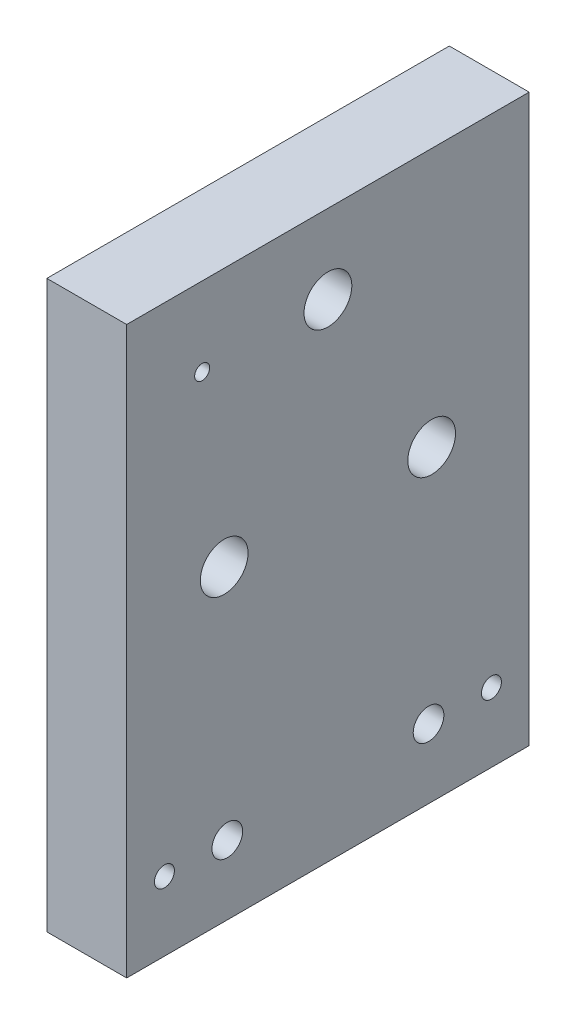
ISO-10303-21;
HEADER;
FILE_DESCRIPTION(('STEP AP214'),'2;1');
FILE_NAME('part.step','',(''),(''),'','','');
FILE_SCHEMA(('AUTOMOTIVE_DESIGN { 1 0 10303 214 1 1 1 1 }'));
ENDSEC;
DATA;
#1=APPLICATION_CONTEXT('core data for automotive mechanical design processes');
#2=APPLICATION_PROTOCOL_DEFINITION('international standard','automotive_design',2000,#1);
#3=PRODUCT_CONTEXT('',#1,'mechanical');
#4=PRODUCT('Part','Part','',(#3));
#5=PRODUCT_RELATED_PRODUCT_CATEGORY('part','',(#4));
#6=PRODUCT_DEFINITION_FORMATION('','',#4);
#7=PRODUCT_DEFINITION_CONTEXT('part definition',#1,'design');
#8=PRODUCT_DEFINITION('design','',#6,#7);
#9=PRODUCT_DEFINITION_SHAPE('','',#8);
#10=(LENGTH_UNIT() NAMED_UNIT(*) SI_UNIT(.MILLI.,.METRE.));
#11=(NAMED_UNIT(*) PLANE_ANGLE_UNIT() SI_UNIT($,.RADIAN.));
#12=(NAMED_UNIT(*) SI_UNIT($,.STERADIAN.) SOLID_ANGLE_UNIT());
#13=UNCERTAINTY_MEASURE_WITH_UNIT(LENGTH_MEASURE(1.E-05),#10,'distance_accuracy_value','');
#14=(GEOMETRIC_REPRESENTATION_CONTEXT(3) GLOBAL_UNCERTAINTY_ASSIGNED_CONTEXT((#13)) GLOBAL_UNIT_ASSIGNED_CONTEXT((#10,
#11,#12)) REPRESENTATION_CONTEXT('',''));
#15=CARTESIAN_POINT('',(0.,0.,0.));
#16=DIRECTION('',(0.,0.,1.));
#17=DIRECTION('',(1.,0.,0.));
#18=AXIS2_PLACEMENT_3D('',#15,#16,#17);
#19=CARTESIAN_POINT('',(6.35,45.,0.));
#20=DIRECTION('',(-1.,0.,0.));
#21=DIRECTION('',(0.,0.,1.));
#22=AXIS2_PLACEMENT_3D('',#19,#20,#21);
#23=PLANE('',#22);
#24=CARTESIAN_POINT('',(6.35,5.50000000000001,29.));
#25=DIRECTION('',(1.,0.,0.));
#26=DIRECTION('',(0.,0.,-1.));
#27=AXIS2_PLACEMENT_3D('',#24,#25,#26);
#28=CIRCLE('',#27,0.793749999999989);
#29=CARTESIAN_POINT('',(6.35,5.50000000000001,28.20625));
#30=VERTEX_POINT('',#29);
#31=EDGE_CURVE('E103',#30,#30,#28,.T.);
#32=ORIENTED_EDGE('',*,*,#31,.F.);
#33=EDGE_LOOP('',(#32));
#34=FACE_BOUND('',#33,.T.);
#35=CARTESIAN_POINT('',(6.35,5.50000000000001,3.));
#36=DIRECTION('',(1.,0.,0.));
#37=DIRECTION('',(0.,0.,-1.));
#38=AXIS2_PLACEMENT_3D('',#35,#36,#37);
#39=CIRCLE('',#38,0.793749999999989);
#40=CARTESIAN_POINT('',(6.35,5.50000000000001,2.20625000000002));
#41=VERTEX_POINT('',#40);
#42=EDGE_CURVE('E102',#41,#41,#39,.T.);
#43=ORIENTED_EDGE('',*,*,#42,.F.);
#44=EDGE_LOOP('',(#43));
#45=FACE_BOUND('',#44,.T.);
#46=CARTESIAN_POINT('',(6.35,5.50000000000001,8.00000000000001));
#47=DIRECTION('',(-1.,0.,0.));
#48=DIRECTION('',(0.,0.,1.));
#49=AXIS2_PLACEMENT_3D('',#46,#47,#48);
#50=CIRCLE('',#49,1.2192);
#51=CARTESIAN_POINT('',(6.35,5.50000000000001,9.21920000000001));
#52=VERTEX_POINT('',#51);
#53=EDGE_CURVE('E116',#52,#52,#50,.T.);
#54=ORIENTED_EDGE('',*,*,#53,.T.);
#55=EDGE_LOOP('',(#54));
#56=FACE_BOUND('',#55,.T.);
#57=CARTESIAN_POINT('',(6.35,5.50000000000001,24.));
#58=DIRECTION('',(-1.,0.,0.));
#59=DIRECTION('',(0.,0.,1.));
#60=AXIS2_PLACEMENT_3D('',#57,#58,#59);
#61=CIRCLE('',#60,1.2192);
#62=CARTESIAN_POINT('',(6.35,5.50000000000001,25.2192));
#63=VERTEX_POINT('',#62);
#64=EDGE_CURVE('E122',#63,#63,#61,.T.);
#65=ORIENTED_EDGE('',*,*,#64,.T.);
#66=EDGE_LOOP('',(#65));
#67=FACE_BOUND('',#66,.T.);
#68=CARTESIAN_POINT('',(6.35,38.7250000001695,26.));
#69=DIRECTION('',(-1.,0.,0.));
#70=DIRECTION('',(0.,0.,1.));
#71=AXIS2_PLACEMENT_3D('',#68,#69,#70);
#72=CIRCLE('',#71,0.595629999999993);
#73=CARTESIAN_POINT('',(6.35,38.7250000001695,26.59563));
#74=VERTEX_POINT('',#73);
#75=EDGE_CURVE('E128',#74,#74,#72,.T.);
#76=ORIENTED_EDGE('',*,*,#75,.T.);
#77=EDGE_LOOP('',(#76));
#78=FACE_BOUND('',#77,.T.);
#79=CARTESIAN_POINT('',(6.35,38.7250000001695,16.));
#80=DIRECTION('',(-1.,0.,0.));
#81=DIRECTION('',(0.,0.,1.));
#82=AXIS2_PLACEMENT_3D('',#79,#80,#81);
#83=CIRCLE('',#82,1.89864999999999);
#84=CARTESIAN_POINT('',(6.35,38.7250000001695,17.89865));
#85=VERTEX_POINT('',#84);
#86=EDGE_CURVE('E39',#85,#85,#83,.T.);
#87=ORIENTED_EDGE('',*,*,#86,.T.);
#88=EDGE_LOOP('',(#87));
#89=FACE_BOUND('',#88,.T.);
#90=CARTESIAN_POINT('',(6.35,24.4375000000845,24.2488919710468));
#91=DIRECTION('',(-1.,0.,0.));
#92=DIRECTION('',(0.,0.,1.));
#93=AXIS2_PLACEMENT_3D('',#90,#91,#92);
#94=CIRCLE('',#93,1.89864999999999);
#95=CARTESIAN_POINT('',(6.35,24.4375000000845,26.1475419710468));
#96=VERTEX_POINT('',#95);
#97=EDGE_CURVE('E149',#96,#96,#94,.T.);
#98=ORIENTED_EDGE('',*,*,#97,.T.);
#99=EDGE_LOOP('',(#98));
#100=FACE_BOUND('',#99,.T.);
#101=CARTESIAN_POINT('',(6.35,24.4375000000845,7.75110802895321));
#102=DIRECTION('',(-1.,0.,0.));
#103=DIRECTION('',(0.,0.,1.));
#104=AXIS2_PLACEMENT_3D('',#101,#102,#103);
#105=CIRCLE('',#104,1.89864999999999);
#106=CARTESIAN_POINT('',(6.35,24.4375000000845,9.6497580289532));
#107=VERTEX_POINT('',#106);
#108=EDGE_CURVE('E159',#107,#107,#105,.T.);
#109=ORIENTED_EDGE('',*,*,#108,.T.);
#110=EDGE_LOOP('',(#109));
#111=FACE_BOUND('',#110,.T.);
#112=DIRECTION('',(0.,0.,-1.));
#113=VECTOR('',#112,1.);
#114=CARTESIAN_POINT('',(6.35,0.,0.));
#115=LINE('',#114,#113);
#116=CARTESIAN_POINT('',(6.35,0.,32.));
#117=VERTEX_POINT('',#116);
#118=CARTESIAN_POINT('',(6.35,0.,0.));
#119=VERTEX_POINT('',#118);
#120=EDGE_CURVE('E167',#117,#119,#115,.T.);
#121=ORIENTED_EDGE('',*,*,#120,.T.);
#122=DIRECTION('',(0.,-1.,0.));
#123=VECTOR('',#122,1.);
#124=CARTESIAN_POINT('',(6.35,45.,0.));
#125=LINE('',#124,#123);
#126=CARTESIAN_POINT('',(6.35,45.,0.));
#127=VERTEX_POINT('',#126);
#128=EDGE_CURVE('E11',#127,#119,#125,.T.);
#129=ORIENTED_EDGE('',*,*,#128,.F.);
#130=DIRECTION('',(0.,0.,-1.));
#131=VECTOR('',#130,1.);
#132=CARTESIAN_POINT('',(6.35,45.,0.));
#133=LINE('',#132,#131);
#134=CARTESIAN_POINT('',(6.35,45.,32.));
#135=VERTEX_POINT('',#134);
#136=EDGE_CURVE('E160',#135,#127,#133,.T.);
#137=ORIENTED_EDGE('',*,*,#136,.F.);
#138=DIRECTION('',(0.,-1.,0.));
#139=VECTOR('',#138,1.);
#140=CARTESIAN_POINT('',(6.35,45.,32.));
#141=LINE('',#140,#139);
#142=EDGE_CURVE('E166',#135,#117,#141,.T.);
#143=ORIENTED_EDGE('',*,*,#142,.T.);
#144=EDGE_LOOP('',(#121,#129,#137,#143));
#145=FACE_BOUND('',#144,.T.);
#146=ADVANCED_FACE('F36',(#34,#45,#56,#67,#78,#89,#100,#111,#145),#23,.F.);
#147=CARTESIAN_POINT('',(6.35,45.,0.));
#148=DIRECTION('',(0.,0.,1.));
#149=DIRECTION('',(1.,0.,0.));
#150=AXIS2_PLACEMENT_3D('',#147,#148,#149);
#151=PLANE('',#150);
#152=DIRECTION('',(-1.,0.,0.));
#153=VECTOR('',#152,1.);
#154=CARTESIAN_POINT('',(6.35,0.,0.));
#155=LINE('',#154,#153);
#156=CARTESIAN_POINT('',(0.,0.,0.));
#157=VERTEX_POINT('',#156);
#158=EDGE_CURVE('E170',#119,#157,#155,.T.);
#159=ORIENTED_EDGE('',*,*,#158,.T.);
#160=DIRECTION('',(0.,-1.,0.));
#161=VECTOR('',#160,1.);
#162=CARTESIAN_POINT('',(0.,45.,0.));
#163=LINE('',#162,#161);
#164=CARTESIAN_POINT('',(0.,45.,0.));
#165=VERTEX_POINT('',#164);
#166=EDGE_CURVE('E45',#165,#157,#163,.T.);
#167=ORIENTED_EDGE('',*,*,#166,.F.);
#168=DIRECTION('',(-1.,0.,0.));
#169=VECTOR('',#168,1.);
#170=CARTESIAN_POINT('',(6.35,45.,0.));
#171=LINE('',#170,#169);
#172=EDGE_CURVE('E85',#127,#165,#171,.T.);
#173=ORIENTED_EDGE('',*,*,#172,.F.);
#174=ORIENTED_EDGE('',*,*,#128,.T.);
#175=EDGE_LOOP('',(#159,#167,#173,#174));
#176=FACE_BOUND('',#175,.T.);
#177=ADVANCED_FACE('F201',(#176),#151,.F.);
#178=CARTESIAN_POINT('',(0.,45.,0.));
#179=DIRECTION('',(1.,0.,0.));
#180=DIRECTION('',(0.,0.,-1.));
#181=AXIS2_PLACEMENT_3D('',#178,#179,#180);
#182=PLANE('',#181);
#183=CARTESIAN_POINT('',(0.,5.50000000000001,8.00000000000001));
#184=DIRECTION('',(-1.,0.,0.));
#185=DIRECTION('',(0.,0.,1.));
#186=AXIS2_PLACEMENT_3D('',#183,#184,#185);
#187=CIRCLE('',#186,1.2192);
#188=CARTESIAN_POINT('',(0.,5.50000000000001,9.21920000000001));
#189=VERTEX_POINT('',#188);
#190=EDGE_CURVE('E113',#189,#189,#187,.T.);
#191=ORIENTED_EDGE('',*,*,#190,.F.);
#192=EDGE_LOOP('',(#191));
#193=FACE_BOUND('',#192,.T.);
#194=CARTESIAN_POINT('',(0.,5.50000000000001,24.));
#195=DIRECTION('',(-1.,0.,0.));
#196=DIRECTION('',(0.,0.,1.));
#197=AXIS2_PLACEMENT_3D('',#194,#195,#196);
#198=CIRCLE('',#197,1.2192);
#199=CARTESIAN_POINT('',(0.,5.50000000000001,25.2192));
#200=VERTEX_POINT('',#199);
#201=EDGE_CURVE('E119',#200,#200,#198,.T.);
#202=ORIENTED_EDGE('',*,*,#201,.F.);
#203=EDGE_LOOP('',(#202));
#204=FACE_BOUND('',#203,.T.);
#205=CARTESIAN_POINT('',(0.,38.7250000001695,26.));
#206=DIRECTION('',(-1.,0.,0.));
#207=DIRECTION('',(0.,0.,1.));
#208=AXIS2_PLACEMENT_3D('',#205,#206,#207);
#209=CIRCLE('',#208,0.595629999999986);
#210=CARTESIAN_POINT('',(0.,38.7250000001695,26.59563));
#211=VERTEX_POINT('',#210);
#212=EDGE_CURVE('E125',#211,#211,#209,.T.);
#213=ORIENTED_EDGE('',*,*,#212,.F.);
#214=EDGE_LOOP('',(#213));
#215=FACE_BOUND('',#214,.T.);
#216=CARTESIAN_POINT('',(0.,38.7250000001695,16.));
#217=DIRECTION('',(-1.,0.,0.));
#218=DIRECTION('',(0.,0.,1.));
#219=AXIS2_PLACEMENT_3D('',#216,#217,#218);
#220=CIRCLE('',#219,4.7625);
#221=CARTESIAN_POINT('',(0.,38.7250000001695,20.7625));
#222=VERTEX_POINT('',#221);
#223=EDGE_CURVE('E131',#222,#222,#220,.T.);
#224=ORIENTED_EDGE('',*,*,#223,.F.);
#225=EDGE_LOOP('',(#224));
#226=FACE_BOUND('',#225,.T.);
#227=CARTESIAN_POINT('',(0.,24.4375000000845,24.2488919710468));
#228=DIRECTION('',(-1.,0.,0.));
#229=DIRECTION('',(0.,0.,1.));
#230=AXIS2_PLACEMENT_3D('',#227,#228,#229);
#231=CIRCLE('',#230,4.7625);
#232=CARTESIAN_POINT('',(0.,24.4375000000845,29.0113919710468));
#233=VERTEX_POINT('',#232);
#234=EDGE_CURVE('E140',#233,#233,#231,.T.);
#235=ORIENTED_EDGE('',*,*,#234,.F.);
#236=EDGE_LOOP('',(#235));
#237=FACE_BOUND('',#236,.T.);
#238=CARTESIAN_POINT('',(0.,24.4375000000845,7.75110802895321));
#239=DIRECTION('',(-1.,0.,0.));
#240=DIRECTION('',(0.,0.,1.));
#241=AXIS2_PLACEMENT_3D('',#238,#239,#240);
#242=CIRCLE('',#241,4.7625);
#243=CARTESIAN_POINT('',(0.,24.4375000000845,12.5136080289532));
#244=VERTEX_POINT('',#243);
#245=EDGE_CURVE('E150',#244,#244,#242,.T.);
#246=ORIENTED_EDGE('',*,*,#245,.F.);
#247=EDGE_LOOP('',(#246));
#248=FACE_BOUND('',#247,.T.);
#249=DIRECTION('',(0.,0.,1.));
#250=VECTOR('',#249,1.);
#251=CARTESIAN_POINT('',(0.,0.,0.));
#252=LINE('',#251,#250);
#253=CARTESIAN_POINT('',(0.,0.,32.));
#254=VERTEX_POINT('',#253);
#255=EDGE_CURVE('E72',#157,#254,#252,.T.);
#256=ORIENTED_EDGE('',*,*,#255,.T.);
#257=DIRECTION('',(0.,-1.,0.));
#258=VECTOR('',#257,1.);
#259=CARTESIAN_POINT('',(0.,45.,32.));
#260=LINE('',#259,#258);
#261=CARTESIAN_POINT('',(0.,45.,32.));
#262=VERTEX_POINT('',#261);
#263=EDGE_CURVE('E175',#262,#254,#260,.T.);
#264=ORIENTED_EDGE('',*,*,#263,.F.);
#265=DIRECTION('',(0.,0.,1.));
#266=VECTOR('',#265,1.);
#267=CARTESIAN_POINT('',(0.,45.,0.));
#268=LINE('',#267,#266);
#269=EDGE_CURVE('E163',#165,#262,#268,.T.);
#270=ORIENTED_EDGE('',*,*,#269,.F.);
#271=ORIENTED_EDGE('',*,*,#166,.T.);
#272=EDGE_LOOP('',(#256,#264,#270,#271));
#273=FACE_BOUND('',#272,.T.);
#274=ADVANCED_FACE('F206',(#193,#204,#215,#226,#237,#248,#273),#182,.F.);
#275=CARTESIAN_POINT('',(6.35,45.,32.));
#276=DIRECTION('',(0.,0.,-1.));
#277=DIRECTION('',(-1.,0.,0.));
#278=AXIS2_PLACEMENT_3D('',#275,#276,#277);
#279=PLANE('',#278);
#280=DIRECTION('',(1.,0.,0.));
#281=VECTOR('',#280,1.);
#282=CARTESIAN_POINT('',(6.35,0.,32.));
#283=LINE('',#282,#281);
#284=EDGE_CURVE('E78',#254,#117,#283,.T.);
#285=ORIENTED_EDGE('',*,*,#284,.T.);
#286=ORIENTED_EDGE('',*,*,#142,.F.);
#287=DIRECTION('',(1.,0.,0.));
#288=VECTOR('',#287,1.);
#289=CARTESIAN_POINT('',(6.35,45.,32.));
#290=LINE('',#289,#288);
#291=EDGE_CURVE('E54',#262,#135,#290,.T.);
#292=ORIENTED_EDGE('',*,*,#291,.F.);
#293=ORIENTED_EDGE('',*,*,#263,.T.);
#294=EDGE_LOOP('',(#285,#286,#292,#293));
#295=FACE_BOUND('',#294,.T.);
#296=ADVANCED_FACE('F360',(#295),#279,.F.);
#297=CARTESIAN_POINT('',(0.,45.,0.));
#298=DIRECTION('',(0.,-1.,0.));
#299=DIRECTION('',(0.,0.,-1.));
#300=AXIS2_PLACEMENT_3D('',#297,#298,#299);
#301=PLANE('',#300);
#302=ORIENTED_EDGE('',*,*,#136,.T.);
#303=ORIENTED_EDGE('',*,*,#172,.T.);
#304=ORIENTED_EDGE('',*,*,#269,.T.);
#305=ORIENTED_EDGE('',*,*,#291,.T.);
#306=EDGE_LOOP('',(#302,#303,#304,#305));
#307=FACE_BOUND('',#306,.T.);
#308=ADVANCED_FACE('F350',(#307),#301,.F.);
#309=CARTESIAN_POINT('',(0.,0.,0.));
#310=DIRECTION('',(0.,-1.,0.));
#311=DIRECTION('',(0.,0.,-1.));
#312=AXIS2_PLACEMENT_3D('',#309,#310,#311);
#313=PLANE('',#312);
#314=ORIENTED_EDGE('',*,*,#120,.F.);
#315=ORIENTED_EDGE('',*,*,#284,.F.);
#316=ORIENTED_EDGE('',*,*,#255,.F.);
#317=ORIENTED_EDGE('',*,*,#158,.F.);
#318=EDGE_LOOP('',(#314,#315,#316,#317));
#319=FACE_BOUND('',#318,.T.);
#320=ADVANCED_FACE('F340',(#319),#313,.T.);
#321=CARTESIAN_POINT('',(0.,24.4375000000845,7.75110802895321));
#322=DIRECTION('',(-1.,0.,0.));
#323=DIRECTION('',(0.,0.,1.));
#324=AXIS2_PLACEMENT_3D('',#321,#322,#323);
#325=CYLINDRICAL_SURFACE('',#324,1.89864999999999);
#326=CARTESIAN_POINT('',(1.016,24.4375000000845,7.75110802895321));
#327=DIRECTION('',(-1.,0.,0.));
#328=DIRECTION('',(0.,0.,1.));
#329=AXIS2_PLACEMENT_3D('',#326,#327,#328);
#330=CIRCLE('',#329,1.89864999999999);
#331=CARTESIAN_POINT('',(1.016,24.4375000000845,9.64975802895321));
#332=VERTEX_POINT('',#331);
#333=EDGE_CURVE('E156',#332,#332,#330,.T.);
#334=ORIENTED_EDGE('',*,*,#333,.T.);
#335=EDGE_LOOP('',(#334));
#336=FACE_BOUND('',#335,.T.);
#337=ORIENTED_EDGE('',*,*,#108,.F.);
#338=EDGE_LOOP('',(#337));
#339=FACE_BOUND('',#338,.T.);
#340=ADVANCED_FACE('F330',(#336,#339),#325,.F.);
#341=CARTESIAN_POINT('',(1.016,26.3361500000845,7.75110802895321));
#342=DIRECTION('',(1.,0.,0.));
#343=DIRECTION('',(0.,0.,-1.));
#344=AXIS2_PLACEMENT_3D('',#341,#342,#343);
#345=PLANE('',#344);
#346=ORIENTED_EDGE('',*,*,#333,.F.);
#347=EDGE_LOOP('',(#346));
#348=FACE_BOUND('',#347,.T.);
#349=CARTESIAN_POINT('',(1.016,24.4375000000845,7.75110802895321));
#350=DIRECTION('',(-1.,0.,0.));
#351=DIRECTION('',(0.,0.,1.));
#352=AXIS2_PLACEMENT_3D('',#349,#350,#351);
#353=CIRCLE('',#352,4.7625);
#354=CARTESIAN_POINT('',(1.016,24.4375000000845,12.5136080289532));
#355=VERTEX_POINT('',#354);
#356=EDGE_CURVE('E153',#355,#355,#353,.T.);
#357=ORIENTED_EDGE('',*,*,#356,.T.);
#358=EDGE_LOOP('',(#357));
#359=FACE_BOUND('',#358,.T.);
#360=ADVANCED_FACE('F197',(#348,#359),#345,.F.);
#361=CARTESIAN_POINT('',(0.,24.4375000000845,7.75110802895321));
#362=DIRECTION('',(-1.,0.,0.));
#363=DIRECTION('',(0.,0.,1.));
#364=AXIS2_PLACEMENT_3D('',#361,#362,#363);
#365=CYLINDRICAL_SURFACE('',#364,4.7625);
#366=ORIENTED_EDGE('',*,*,#356,.F.);
#367=EDGE_LOOP('',(#366));
#368=FACE_BOUND('',#367,.T.);
#369=ORIENTED_EDGE('',*,*,#245,.T.);
#370=EDGE_LOOP('',(#369));
#371=FACE_BOUND('',#370,.T.);
#372=ADVANCED_FACE('F187',(#368,#371),#365,.F.);
#373=CARTESIAN_POINT('',(0.,24.4375000000845,24.2488919710468));
#374=DIRECTION('',(-1.,0.,0.));
#375=DIRECTION('',(0.,0.,1.));
#376=AXIS2_PLACEMENT_3D('',#373,#374,#375);
#377=CYLINDRICAL_SURFACE('',#376,1.89864999999999);
#378=CARTESIAN_POINT('',(1.016,24.4375000000845,24.2488919710468));
#379=DIRECTION('',(-1.,0.,0.));
#380=DIRECTION('',(0.,0.,1.));
#381=AXIS2_PLACEMENT_3D('',#378,#379,#380);
#382=CIRCLE('',#381,1.89864999999999);
#383=CARTESIAN_POINT('',(1.016,24.4375000000845,26.1475419710468));
#384=VERTEX_POINT('',#383);
#385=EDGE_CURVE('E146',#384,#384,#382,.T.);
#386=ORIENTED_EDGE('',*,*,#385,.T.);
#387=EDGE_LOOP('',(#386));
#388=FACE_BOUND('',#387,.T.);
#389=ORIENTED_EDGE('',*,*,#97,.F.);
#390=EDGE_LOOP('',(#389));
#391=FACE_BOUND('',#390,.T.);
#392=ADVANCED_FACE('F184',(#388,#391),#377,.F.);
#393=CARTESIAN_POINT('',(1.016,26.3361500000845,24.2488919710468));
#394=DIRECTION('',(1.,0.,0.));
#395=DIRECTION('',(0.,0.,-1.));
#396=AXIS2_PLACEMENT_3D('',#393,#394,#395);
#397=PLANE('',#396);
#398=ORIENTED_EDGE('',*,*,#385,.F.);
#399=EDGE_LOOP('',(#398));
#400=FACE_BOUND('',#399,.T.);
#401=CARTESIAN_POINT('',(1.016,24.4375000000845,24.2488919710468));
#402=DIRECTION('',(-1.,0.,0.));
#403=DIRECTION('',(0.,0.,1.));
#404=AXIS2_PLACEMENT_3D('',#401,#402,#403);
#405=CIRCLE('',#404,4.7625);
#406=CARTESIAN_POINT('',(1.016,24.4375000000845,29.0113919710468));
#407=VERTEX_POINT('',#406);
#408=EDGE_CURVE('E143',#407,#407,#405,.T.);
#409=ORIENTED_EDGE('',*,*,#408,.T.);
#410=EDGE_LOOP('',(#409));
#411=FACE_BOUND('',#410,.T.);
#412=ADVANCED_FACE('F186',(#400,#411),#397,.F.);
#413=CARTESIAN_POINT('',(0.,24.4375000000845,24.2488919710468));
#414=DIRECTION('',(-1.,0.,0.));
#415=DIRECTION('',(0.,0.,1.));
#416=AXIS2_PLACEMENT_3D('',#413,#414,#415);
#417=CYLINDRICAL_SURFACE('',#416,4.7625);
#418=ORIENTED_EDGE('',*,*,#408,.F.);
#419=EDGE_LOOP('',(#418));
#420=FACE_BOUND('',#419,.T.);
#421=ORIENTED_EDGE('',*,*,#234,.T.);
#422=EDGE_LOOP('',(#421));
#423=FACE_BOUND('',#422,.T.);
#424=ADVANCED_FACE('F194',(#420,#423),#417,.F.);
#425=CARTESIAN_POINT('',(0.,38.7250000001695,16.));
#426=DIRECTION('',(-1.,0.,0.));
#427=DIRECTION('',(0.,0.,1.));
#428=AXIS2_PLACEMENT_3D('',#425,#426,#427);
#429=CYLINDRICAL_SURFACE('',#428,1.89864999999999);
#430=CARTESIAN_POINT('',(1.016,38.7250000001695,16.));
#431=DIRECTION('',(-1.,0.,0.));
#432=DIRECTION('',(0.,0.,1.));
#433=AXIS2_PLACEMENT_3D('',#430,#431,#432);
#434=CIRCLE('',#433,1.89864999999999);
#435=CARTESIAN_POINT('',(1.016,38.7250000001695,17.89865));
#436=VERTEX_POINT('',#435);
#437=EDGE_CURVE('E137',#436,#436,#434,.T.);
#438=ORIENTED_EDGE('',*,*,#437,.T.);
#439=EDGE_LOOP('',(#438));
#440=FACE_BOUND('',#439,.T.);
#441=ORIENTED_EDGE('',*,*,#86,.F.);
#442=EDGE_LOOP('',(#441));
#443=FACE_BOUND('',#442,.T.);
#444=ADVANCED_FACE('F220',(#440,#443),#429,.F.);
#445=CARTESIAN_POINT('',(1.016,40.6236500001695,16.));
#446=DIRECTION('',(1.,0.,0.));
#447=DIRECTION('',(0.,0.,-1.));
#448=AXIS2_PLACEMENT_3D('',#445,#446,#447);
#449=PLANE('',#448);
#450=ORIENTED_EDGE('',*,*,#437,.F.);
#451=EDGE_LOOP('',(#450));
#452=FACE_BOUND('',#451,.T.);
#453=CARTESIAN_POINT('',(1.016,38.7250000001695,16.));
#454=DIRECTION('',(-1.,0.,0.));
#455=DIRECTION('',(0.,0.,1.));
#456=AXIS2_PLACEMENT_3D('',#453,#454,#455);
#457=CIRCLE('',#456,4.7625);
#458=CARTESIAN_POINT('',(1.016,38.7250000001695,20.7625));
#459=VERTEX_POINT('',#458);
#460=EDGE_CURVE('E134',#459,#459,#457,.T.);
#461=ORIENTED_EDGE('',*,*,#460,.T.);
#462=EDGE_LOOP('',(#461));
#463=FACE_BOUND('',#462,.T.);
#464=ADVANCED_FACE('F222',(#452,#463),#449,.F.);
#465=CARTESIAN_POINT('',(0.,38.7250000001695,16.));
#466=DIRECTION('',(-1.,0.,0.));
#467=DIRECTION('',(0.,0.,1.));
#468=AXIS2_PLACEMENT_3D('',#465,#466,#467);
#469=CYLINDRICAL_SURFACE('',#468,4.7625);
#470=ORIENTED_EDGE('',*,*,#460,.F.);
#471=EDGE_LOOP('',(#470));
#472=FACE_BOUND('',#471,.T.);
#473=ORIENTED_EDGE('',*,*,#223,.T.);
#474=EDGE_LOOP('',(#473));
#475=FACE_BOUND('',#474,.T.);
#476=ADVANCED_FACE('F229',(#472,#475),#469,.F.);
#477=CARTESIAN_POINT('',(0.,38.7250000001695,26.));
#478=DIRECTION('',(-1.,0.,0.));
#479=DIRECTION('',(0.,0.,1.));
#480=AXIS2_PLACEMENT_3D('',#477,#478,#479);
#481=CYLINDRICAL_SURFACE('',#480,0.595629999999989);
#482=ORIENTED_EDGE('',*,*,#75,.F.);
#483=EDGE_LOOP('',(#482));
#484=FACE_BOUND('',#483,.T.);
#485=ORIENTED_EDGE('',*,*,#212,.T.);
#486=EDGE_LOOP('',(#485));
#487=FACE_BOUND('',#486,.T.);
#488=ADVANCED_FACE('F237',(#484,#487),#481,.F.);
#489=CARTESIAN_POINT('',(0.,5.50000000000001,24.));
#490=DIRECTION('',(-1.,0.,0.));
#491=DIRECTION('',(0.,0.,1.));
#492=AXIS2_PLACEMENT_3D('',#489,#490,#491);
#493=CYLINDRICAL_SURFACE('',#492,1.2192);
#494=ORIENTED_EDGE('',*,*,#201,.T.);
#495=EDGE_LOOP('',(#494));
#496=FACE_BOUND('',#495,.T.);
#497=ORIENTED_EDGE('',*,*,#64,.F.);
#498=EDGE_LOOP('',(#497));
#499=FACE_BOUND('',#498,.T.);
#500=ADVANCED_FACE('F241',(#496,#499),#493,.F.);
#501=CARTESIAN_POINT('',(0.,5.50000000000001,8.00000000000001));
#502=DIRECTION('',(-1.,0.,0.));
#503=DIRECTION('',(0.,0.,1.));
#504=AXIS2_PLACEMENT_3D('',#501,#502,#503);
#505=CYLINDRICAL_SURFACE('',#504,1.2192);
#506=ORIENTED_EDGE('',*,*,#190,.T.);
#507=EDGE_LOOP('',(#506));
#508=FACE_BOUND('',#507,.T.);
#509=ORIENTED_EDGE('',*,*,#53,.F.);
#510=EDGE_LOOP('',(#509));
#511=FACE_BOUND('',#510,.T.);
#512=ADVANCED_FACE('F245',(#508,#511),#505,.F.);
#513=CARTESIAN_POINT('',(2.82693311635313,5.50000000000001,3.));
#514=DIRECTION('',(1.,0.,0.));
#515=DIRECTION('',(0.,0.,-1.));
#516=AXIS2_PLACEMENT_3D('',#513,#514,#515);
#517=CONICAL_SURFACE('',#516,0.793749999999999,1.02974425867665);
#518=CARTESIAN_POINT('',(2.35,5.50000000000001,3.));
#519=VERTEX_POINT('',#518);
#520=VERTEX_LOOP('',#519);
#521=FACE_BOUND('',#520,.T.);
#522=CARTESIAN_POINT('',(2.82693311635313,5.50000000000001,3.));
#523=DIRECTION('',(1.,0.,0.));
#524=DIRECTION('',(0.,0.,-1.));
#525=AXIS2_PLACEMENT_3D('',#522,#523,#524);
#526=CIRCLE('',#525,0.793749999999999);
#527=CARTESIAN_POINT('',(2.82693311635313,5.50000000000001,2.20625000000001));
#528=VERTEX_POINT('',#527);
#529=EDGE_CURVE('E106',#528,#528,#526,.T.);
#530=ORIENTED_EDGE('',*,*,#529,.T.);
#531=EDGE_LOOP('',(#530));
#532=FACE_BOUND('',#531,.T.);
#533=ADVANCED_FACE('F249',(#521,#532),#517,.F.);
#534=CARTESIAN_POINT('',(6.35,5.50000000000001,3.));
#535=DIRECTION('',(1.,0.,0.));
#536=DIRECTION('',(0.,0.,-1.));
#537=AXIS2_PLACEMENT_3D('',#534,#535,#536);
#538=CYLINDRICAL_SURFACE('',#537,0.793749999999994);
#539=ORIENTED_EDGE('',*,*,#529,.F.);
#540=EDGE_LOOP('',(#539));
#541=FACE_BOUND('',#540,.T.);
#542=ORIENTED_EDGE('',*,*,#42,.T.);
#543=EDGE_LOOP('',(#542));
#544=FACE_BOUND('',#543,.T.);
#545=ADVANCED_FACE('F96',(#541,#544),#538,.F.);
#546=CARTESIAN_POINT('',(2.82693311635313,5.50000000000001,29.));
#547=DIRECTION('',(1.,0.,0.));
#548=DIRECTION('',(0.,0.,-1.));
#549=AXIS2_PLACEMENT_3D('',#546,#547,#548);
#550=CONICAL_SURFACE('',#549,0.793749999999999,1.02974425867665);
#551=CARTESIAN_POINT('',(2.35,5.50000000000001,29.));
#552=VERTEX_POINT('',#551);
#553=VERTEX_LOOP('',#552);
#554=FACE_BOUND('',#553,.T.);
#555=CARTESIAN_POINT('',(2.82693311635313,5.50000000000001,29.));
#556=DIRECTION('',(1.,0.,0.));
#557=DIRECTION('',(0.,0.,-1.));
#558=AXIS2_PLACEMENT_3D('',#555,#556,#557);
#559=CIRCLE('',#558,0.793749999999999);
#560=CARTESIAN_POINT('',(2.82693311635313,5.50000000000001,28.20625));
#561=VERTEX_POINT('',#560);
#562=EDGE_CURVE('E100',#561,#561,#559,.T.);
#563=ORIENTED_EDGE('',*,*,#562,.T.);
#564=EDGE_LOOP('',(#563));
#565=FACE_BOUND('',#564,.T.);
#566=ADVANCED_FACE('F92',(#554,#565),#550,.F.);
#567=CARTESIAN_POINT('',(6.35,5.50000000000001,29.));
#568=DIRECTION('',(1.,0.,0.));
#569=DIRECTION('',(0.,0.,-1.));
#570=AXIS2_PLACEMENT_3D('',#567,#568,#569);
#571=CYLINDRICAL_SURFACE('',#570,0.793749999999994);
#572=ORIENTED_EDGE('',*,*,#562,.F.);
#573=EDGE_LOOP('',(#572));
#574=FACE_BOUND('',#573,.T.);
#575=ORIENTED_EDGE('',*,*,#31,.T.);
#576=EDGE_LOOP('',(#575));
#577=FACE_BOUND('',#576,.T.);
#578=ADVANCED_FACE('F95',(#574,#577),#571,.F.);
#579=CLOSED_SHELL('',(#146,#177,#274,#296,#308,#320,#340,#360,#372,#392,#412,#424,#444,#464,
#476,#488,#500,#512,#533,#545,#566,#578));
#580=MANIFOLD_SOLID_BREP('B2',#579);
#581=ADVANCED_BREP_SHAPE_REPRESENTATION('',(#18,#580),#14);
#582=SHAPE_DEFINITION_REPRESENTATION(#9,#581);
ENDSEC;
END-ISO-10303-21;
